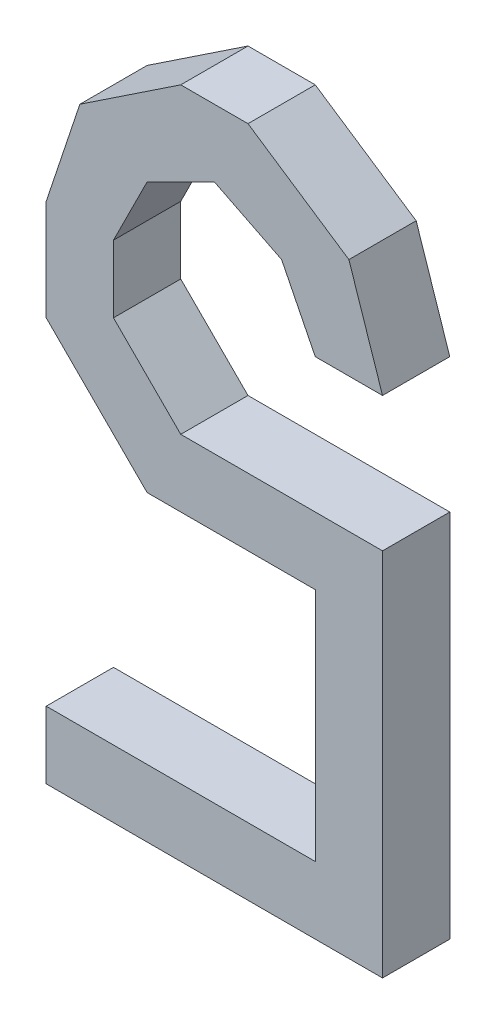
ISO-10303-21;
HEADER;
FILE_DESCRIPTION(('STEP AP214'),'2;1');
FILE_NAME('part.step','',(''),(''),'','','');
FILE_SCHEMA(('AUTOMOTIVE_DESIGN { 1 0 10303 214 1 1 1 1 }'));
ENDSEC;
DATA;
#1=APPLICATION_CONTEXT('core data for automotive mechanical design processes');
#2=APPLICATION_PROTOCOL_DEFINITION('international standard','automotive_design',2000,#1);
#3=PRODUCT_CONTEXT('',#1,'mechanical');
#4=PRODUCT('Part','Part','',(#3));
#5=PRODUCT_RELATED_PRODUCT_CATEGORY('part','',(#4));
#6=PRODUCT_DEFINITION_FORMATION('','',#4);
#7=PRODUCT_DEFINITION_CONTEXT('part definition',#1,'design');
#8=PRODUCT_DEFINITION('design','',#6,#7);
#9=PRODUCT_DEFINITION_SHAPE('','',#8);
#10=(LENGTH_UNIT() NAMED_UNIT(*) SI_UNIT(.MILLI.,.METRE.));
#11=(NAMED_UNIT(*) PLANE_ANGLE_UNIT() SI_UNIT($,.RADIAN.));
#12=(NAMED_UNIT(*) SI_UNIT($,.STERADIAN.) SOLID_ANGLE_UNIT());
#13=UNCERTAINTY_MEASURE_WITH_UNIT(LENGTH_MEASURE(1.E-05),#10,'distance_accuracy_value','');
#14=(GEOMETRIC_REPRESENTATION_CONTEXT(3) GLOBAL_UNCERTAINTY_ASSIGNED_CONTEXT((#13)) GLOBAL_UNIT_ASSIGNED_CONTEXT((#10,
#11,#12)) REPRESENTATION_CONTEXT('',''));
#15=CARTESIAN_POINT('',(0.,0.,0.));
#16=DIRECTION('',(0.,0.,1.));
#17=DIRECTION('',(1.,0.,0.));
#18=AXIS2_PLACEMENT_3D('',#15,#16,#17);
#19=CARTESIAN_POINT('',(-0.0635,-0.127,0.0254));
#20=DIRECTION('',(0.,0.,1.));
#21=DIRECTION('',(1.,0.,0.));
#22=AXIS2_PLACEMENT_3D('',#19,#20,#21);
#23=PLANE('',#22);
#24=DIRECTION('',(1.,0.,0.));
#25=VECTOR('',#24,1.);
#26=CARTESIAN_POINT('',(-0.0635,-0.1016,0.0254));
#27=LINE('',#26,#25);
#28=CARTESIAN_POINT('',(-0.0635,-0.1016,0.0254));
#29=VERTEX_POINT('',#28);
#30=CARTESIAN_POINT('',(0.0381,-0.1016,0.0254));
#31=VERTEX_POINT('',#30);
#32=EDGE_CURVE('E247',#29,#31,#27,.T.);
#33=ORIENTED_EDGE('',*,*,#32,.F.);
#34=DIRECTION('',(0.,1.,0.));
#35=VECTOR('',#34,1.);
#36=CARTESIAN_POINT('',(-0.0635,-0.127,0.0254));
#37=LINE('',#36,#35);
#38=CARTESIAN_POINT('',(-0.0635,-0.127,0.0254));
#39=VERTEX_POINT('',#38);
#40=EDGE_CURVE('E172',#39,#29,#37,.T.);
#41=ORIENTED_EDGE('',*,*,#40,.F.);
#42=DIRECTION('',(1.,0.,0.));
#43=VECTOR('',#42,1.);
#44=CARTESIAN_POINT('',(0.0635,-0.127,0.0254));
#45=LINE('',#44,#43);
#46=CARTESIAN_POINT('',(0.0635,-0.127,0.0254));
#47=VERTEX_POINT('',#46);
#48=EDGE_CURVE('E20',#47,#39,#45,.F.);
#49=ORIENTED_EDGE('',*,*,#48,.F.);
#50=DIRECTION('',(0.,1.,0.));
#51=VECTOR('',#50,1.);
#52=CARTESIAN_POINT('',(0.0635,0.0127,0.0254));
#53=LINE('',#52,#51);
#54=CARTESIAN_POINT('',(0.0635,0.0127,0.0254));
#55=VERTEX_POINT('',#54);
#56=EDGE_CURVE('E161',#55,#47,#53,.F.);
#57=ORIENTED_EDGE('',*,*,#56,.F.);
#58=DIRECTION('',(1.,0.,0.));
#59=VECTOR('',#58,1.);
#60=CARTESIAN_POINT('',(-0.0127,0.0127,0.0254));
#61=LINE('',#60,#59);
#62=CARTESIAN_POINT('',(-0.0126999999999968,0.0127000000000032,0.0254));
#63=VERTEX_POINT('',#62);
#64=EDGE_CURVE('E156',#63,#55,#61,.T.);
#65=ORIENTED_EDGE('',*,*,#64,.F.);
#66=DIRECTION('',(-0.707106781187048,0.707106781186048,0.));
#67=VECTOR('',#66,1.);
#68=CARTESIAN_POINT('',(-0.0381,0.03809999999999,0.0254));
#69=LINE('',#68,#67);
#70=CARTESIAN_POINT('',(-0.0381,0.03809999999999,0.0254));
#71=VERTEX_POINT('',#70);
#72=EDGE_CURVE('E183',#71,#63,#69,.F.);
#73=ORIENTED_EDGE('',*,*,#72,.F.);
#74=DIRECTION('',(0.,1.,0.));
#75=VECTOR('',#74,1.);
#76=CARTESIAN_POINT('',(-0.0381,0.06349999999998,0.0254));
#77=LINE('',#76,#75);
#78=CARTESIAN_POINT('',(-0.038100000000002,0.063499999999981,0.0254));
#79=VERTEX_POINT('',#78);
#80=EDGE_CURVE('E187',#79,#71,#77,.F.);
#81=ORIENTED_EDGE('',*,*,#80,.F.);
#82=DIRECTION('',(0.447213595499958,0.894427190999916,0.));
#83=VECTOR('',#82,1.);
#84=CARTESIAN_POINT('',(-0.0254,0.0889,0.0254));
#85=LINE('',#84,#83);
#86=CARTESIAN_POINT('',(-0.0254,0.0889,0.0254));
#87=VERTEX_POINT('',#86);
#88=EDGE_CURVE('E191',#87,#79,#85,.F.);
#89=ORIENTED_EDGE('',*,*,#88,.F.);
#90=DIRECTION('',(0.894427190999916,0.447213595499958,0.));
#91=VECTOR('',#90,1.);
#92=CARTESIAN_POINT('',(0.,0.1016,0.0254));
#93=LINE('',#92,#91);
#94=CARTESIAN_POINT('',(0.,0.1016,0.0254));
#95=VERTEX_POINT('',#94);
#96=EDGE_CURVE('E195',#95,#87,#93,.F.);
#97=ORIENTED_EDGE('',*,*,#96,.F.);
#98=DIRECTION('',(0.894427190999916,-0.447213595499958,0.));
#99=VECTOR('',#98,1.);
#100=CARTESIAN_POINT('',(0.0254,0.0889,0.0254));
#101=LINE('',#100,#99);
#102=CARTESIAN_POINT('',(0.025399999999998,0.088899999999999,0.0254));
#103=VERTEX_POINT('',#102);
#104=EDGE_CURVE('E199',#103,#95,#101,.F.);
#105=ORIENTED_EDGE('',*,*,#104,.F.);
#106=DIRECTION('',(0.447213595499958,-0.894427190999916,0.));
#107=VECTOR('',#106,1.);
#108=CARTESIAN_POINT('',(0.0381,0.06349999999998,0.0254));
#109=LINE('',#108,#107);
#110=CARTESIAN_POINT('',(0.0381,0.06349999999998,0.0254));
#111=VERTEX_POINT('',#110);
#112=EDGE_CURVE('E203',#111,#103,#109,.F.);
#113=ORIENTED_EDGE('',*,*,#112,.F.);
#114=DIRECTION('',(1.,0.,0.));
#115=VECTOR('',#114,1.);
#116=CARTESIAN_POINT('',(0.0635,0.06349999999998,0.0254));
#117=LINE('',#116,#115);
#118=CARTESIAN_POINT('',(0.0635000000000045,0.0634999999999815,0.0254));
#119=VERTEX_POINT('',#118);
#120=EDGE_CURVE('E207',#119,#111,#117,.F.);
#121=ORIENTED_EDGE('',*,*,#120,.F.);
#122=DIRECTION('',(-0.316227766017138,0.948683298050414,0.));
#123=VECTOR('',#122,1.);
#124=CARTESIAN_POINT('',(0.0508,0.1016,0.0254));
#125=LINE('',#124,#123);
#126=CARTESIAN_POINT('',(0.0508000000000018,0.101600000000003,0.0254));
#127=VERTEX_POINT('',#126);
#128=EDGE_CURVE('E211',#127,#119,#125,.F.);
#129=ORIENTED_EDGE('',*,*,#128,.F.);
#130=DIRECTION('',(-0.832050294337997,0.554700196224998,0.));
#131=VECTOR('',#130,1.);
#132=CARTESIAN_POINT('',(0.0127,0.127,0.0254));
#133=LINE('',#132,#131);
#134=CARTESIAN_POINT('',(0.0127,0.127,0.0254));
#135=VERTEX_POINT('',#134);
#136=EDGE_CURVE('E215',#135,#127,#133,.F.);
#137=ORIENTED_EDGE('',*,*,#136,.F.);
#138=DIRECTION('',(1.,0.,0.));
#139=VECTOR('',#138,1.);
#140=CARTESIAN_POINT('',(-0.0127,0.127,0.0254));
#141=LINE('',#140,#139);
#142=CARTESIAN_POINT('',(-0.0126999999999982,0.126999999999997,0.0254));
#143=VERTEX_POINT('',#142);
#144=EDGE_CURVE('E219',#143,#135,#141,.T.);
#145=ORIENTED_EDGE('',*,*,#144,.F.);
#146=DIRECTION('',(-0.832050294337997,-0.554700196224998,0.));
#147=VECTOR('',#146,1.);
#148=CARTESIAN_POINT('',(-0.0508,0.1016,0.0254));
#149=LINE('',#148,#147);
#150=CARTESIAN_POINT('',(-0.0507999999999955,0.101599999999999,0.0254));
#151=VERTEX_POINT('',#150);
#152=EDGE_CURVE('E223',#151,#143,#149,.F.);
#153=ORIENTED_EDGE('',*,*,#152,.F.);
#154=DIRECTION('',(-0.316227766017138,-0.948683298050414,0.));
#155=VECTOR('',#154,1.);
#156=CARTESIAN_POINT('',(-0.0635,0.06349999999998,0.0254));
#157=LINE('',#156,#155);
#158=CARTESIAN_POINT('',(-0.0635,0.06349999999998,0.0254));
#159=VERTEX_POINT('',#158);
#160=EDGE_CURVE('E227',#159,#151,#157,.F.);
#161=ORIENTED_EDGE('',*,*,#160,.F.);
#162=DIRECTION('',(0.,1.,0.));
#163=VECTOR('',#162,1.);
#164=CARTESIAN_POINT('',(-0.0635,0.02539999999999,0.0254));
#165=LINE('',#164,#163);
#166=CARTESIAN_POINT('',(-0.0634999999999945,0.0253999999999955,0.0254));
#167=VERTEX_POINT('',#166);
#168=EDGE_CURVE('E231',#167,#159,#165,.T.);
#169=ORIENTED_EDGE('',*,*,#168,.F.);
#170=DIRECTION('',(0.707106781186048,-0.707106781187048,0.));
#171=VECTOR('',#170,1.);
#172=CARTESIAN_POINT('',(-0.0254,-0.01270000000002,0.0254));
#173=LINE('',#172,#171);
#174=CARTESIAN_POINT('',(-0.0254,-0.01270000000002,0.0254));
#175=VERTEX_POINT('',#174);
#176=EDGE_CURVE('E235',#175,#167,#173,.F.);
#177=ORIENTED_EDGE('',*,*,#176,.F.);
#178=DIRECTION('',(1.,0.,0.));
#179=VECTOR('',#178,1.);
#180=CARTESIAN_POINT('',(0.0381,-0.01270000000002,0.0254));
#181=LINE('',#180,#179);
#182=CARTESIAN_POINT('',(0.0381,-0.01270000000002,0.0254));
#183=VERTEX_POINT('',#182);
#184=EDGE_CURVE('E239',#183,#175,#181,.F.);
#185=ORIENTED_EDGE('',*,*,#184,.F.);
#186=DIRECTION('',(0.,1.,0.));
#187=VECTOR('',#186,1.);
#188=CARTESIAN_POINT('',(0.0381,-0.1016,0.0254));
#189=LINE('',#188,#187);
#190=EDGE_CURVE('E243',#31,#183,#189,.T.);
#191=ORIENTED_EDGE('',*,*,#190,.F.);
#192=EDGE_LOOP('',(#33,#41,#49,#57,#65,#73,#81,#89,#97,#105,#113,#121,#129,#137,#145,#153,#161,
#169,#177,#185,#191));
#193=FACE_BOUND('',#192,.T.);
#194=ADVANCED_FACE('F17',(#193),#23,.T.);
#195=CARTESIAN_POINT('',(0.0635,-0.127,0.));
#196=DIRECTION('',(0.,-1.,0.));
#197=DIRECTION('',(0.,0.,-1.));
#198=AXIS2_PLACEMENT_3D('',#195,#196,#197);
#199=PLANE('',#198);
#200=DIRECTION('',(0.,0.,1.));
#201=VECTOR('',#200,1.);
#202=CARTESIAN_POINT('',(-0.0635,-0.127,0.));
#203=LINE('',#202,#201);
#204=CARTESIAN_POINT('',(-0.0635,-0.127,0.));
#205=VERTEX_POINT('',#204);
#206=EDGE_CURVE('E251',#205,#39,#203,.T.);
#207=ORIENTED_EDGE('',*,*,#206,.F.);
#208=DIRECTION('',(1.,0.,0.));
#209=VECTOR('',#208,1.);
#210=CARTESIAN_POINT('',(-0.0635,-0.127,0.));
#211=LINE('',#210,#209);
#212=CARTESIAN_POINT('',(0.0635,-0.127,0.));
#213=VERTEX_POINT('',#212);
#214=EDGE_CURVE('E178',#205,#213,#211,.T.);
#215=ORIENTED_EDGE('',*,*,#214,.T.);
#216=DIRECTION('',(0.,0.,-1.));
#217=VECTOR('',#216,1.);
#218=CARTESIAN_POINT('',(0.0635,-0.127,0.));
#219=LINE('',#218,#217);
#220=EDGE_CURVE('E166',#47,#213,#219,.T.);
#221=ORIENTED_EDGE('',*,*,#220,.F.);
#222=ORIENTED_EDGE('',*,*,#48,.T.);
#223=EDGE_LOOP('',(#207,#215,#221,#222));
#224=FACE_BOUND('',#223,.T.);
#225=ADVANCED_FACE('F177',(#224),#199,.T.);
#226=CARTESIAN_POINT('',(0.0635,0.0127,0.));
#227=DIRECTION('',(1.,0.,0.));
#228=DIRECTION('',(0.,0.,-1.));
#229=AXIS2_PLACEMENT_3D('',#226,#227,#228);
#230=PLANE('',#229);
#231=ORIENTED_EDGE('',*,*,#220,.T.);
#232=DIRECTION('',(0.,1.,0.));
#233=VECTOR('',#232,1.);
#234=CARTESIAN_POINT('',(0.0635,-0.127,0.));
#235=LINE('',#234,#233);
#236=CARTESIAN_POINT('',(0.0635,0.0127,0.));
#237=VERTEX_POINT('',#236);
#238=EDGE_CURVE('E256',#213,#237,#235,.T.);
#239=ORIENTED_EDGE('',*,*,#238,.T.);
#240=DIRECTION('',(0.,0.,1.));
#241=VECTOR('',#240,1.);
#242=CARTESIAN_POINT('',(0.0635,0.0127,0.));
#243=LINE('',#242,#241);
#244=EDGE_CURVE('E168',#55,#237,#243,.F.);
#245=ORIENTED_EDGE('',*,*,#244,.F.);
#246=ORIENTED_EDGE('',*,*,#56,.T.);
#247=EDGE_LOOP('',(#231,#239,#245,#246));
#248=FACE_BOUND('',#247,.T.);
#249=ADVANCED_FACE('F163',(#248),#230,.T.);
#250=CARTESIAN_POINT('',(-0.0127,0.0127,0.));
#251=DIRECTION('',(0.,1.,0.));
#252=DIRECTION('',(0.,0.,1.));
#253=AXIS2_PLACEMENT_3D('',#250,#251,#252);
#254=PLANE('',#253);
#255=ORIENTED_EDGE('',*,*,#244,.T.);
#256=DIRECTION('',(1.,0.,0.));
#257=VECTOR('',#256,1.);
#258=CARTESIAN_POINT('',(-0.0635,0.0127,0.));
#259=LINE('',#258,#257);
#260=CARTESIAN_POINT('',(-0.0126999999999968,0.0127000000000032,0.));
#261=VERTEX_POINT('',#260);
#262=EDGE_CURVE('E258',#237,#261,#259,.F.);
#263=ORIENTED_EDGE('',*,*,#262,.T.);
#264=DIRECTION('',(0.,0.,1.));
#265=VECTOR('',#264,1.);
#266=CARTESIAN_POINT('',(-0.012699999999987,0.012700000000013,0.));
#267=LINE('',#266,#265);
#268=EDGE_CURVE('E185',#63,#261,#267,.F.);
#269=ORIENTED_EDGE('',*,*,#268,.F.);
#270=ORIENTED_EDGE('',*,*,#64,.T.);
#271=EDGE_LOOP('',(#255,#263,#269,#270));
#272=FACE_BOUND('',#271,.T.);
#273=ADVANCED_FACE('F396',(#272),#254,.T.);
#274=CARTESIAN_POINT('',(-0.0381,0.03809999999999,0.));
#275=DIRECTION('',(0.707106781186048,0.707106781187048,0.));
#276=DIRECTION('',(-0.707106781187048,0.707106781186048,0.));
#277=AXIS2_PLACEMENT_3D('',#274,#275,#276);
#278=PLANE('',#277);
#279=ORIENTED_EDGE('',*,*,#268,.T.);
#280=DIRECTION('',(-0.707106781186687,0.707106781186408,0.));
#281=VECTOR('',#280,1.);
#282=CARTESIAN_POINT('',(-0.0127,0.0127,0.));
#283=LINE('',#282,#281);
#284=CARTESIAN_POINT('',(-0.0381,0.03809999999999,0.));
#285=VERTEX_POINT('',#284);
#286=EDGE_CURVE('E261',#261,#285,#283,.T.);
#287=ORIENTED_EDGE('',*,*,#286,.T.);
#288=DIRECTION('',(0.,0.,-1.));
#289=VECTOR('',#288,1.);
#290=CARTESIAN_POINT('',(-0.0381,0.03809999999999,0.));
#291=LINE('',#290,#289);
#292=EDGE_CURVE('E189',#71,#285,#291,.T.);
#293=ORIENTED_EDGE('',*,*,#292,.F.);
#294=ORIENTED_EDGE('',*,*,#72,.T.);
#295=EDGE_LOOP('',(#279,#287,#293,#294));
#296=FACE_BOUND('',#295,.T.);
#297=ADVANCED_FACE('F394',(#296),#278,.T.);
#298=CARTESIAN_POINT('',(-0.0381,0.06349999999998,0.));
#299=DIRECTION('',(1.,0.,0.));
#300=DIRECTION('',(0.,0.,-1.));
#301=AXIS2_PLACEMENT_3D('',#298,#299,#300);
#302=PLANE('',#301);
#303=ORIENTED_EDGE('',*,*,#292,.T.);
#304=DIRECTION('',(0.,1.,0.));
#305=VECTOR('',#304,1.);
#306=CARTESIAN_POINT('',(-0.0381,-0.127,0.));
#307=LINE('',#306,#305);
#308=CARTESIAN_POINT('',(-0.038100000000002,0.063499999999981,0.));
#309=VERTEX_POINT('',#308);
#310=EDGE_CURVE('E264',#285,#309,#307,.T.);
#311=ORIENTED_EDGE('',*,*,#310,.T.);
#312=DIRECTION('',(0.,0.,1.));
#313=VECTOR('',#312,1.);
#314=CARTESIAN_POINT('',(-0.038100000000008,0.063499999999984,0.));
#315=LINE('',#314,#313);
#316=EDGE_CURVE('E193',#79,#309,#315,.F.);
#317=ORIENTED_EDGE('',*,*,#316,.F.);
#318=ORIENTED_EDGE('',*,*,#80,.T.);
#319=EDGE_LOOP('',(#303,#311,#317,#318));
#320=FACE_BOUND('',#319,.T.);
#321=ADVANCED_FACE('F390',(#320),#302,.T.);
#322=CARTESIAN_POINT('',(-0.0254,0.0889,0.));
#323=DIRECTION('',(0.894427190999916,-0.447213595499958,0.));
#324=DIRECTION('',(0.447213595499958,0.894427190999916,0.));
#325=AXIS2_PLACEMENT_3D('',#322,#323,#324);
#326=PLANE('',#325);
#327=ORIENTED_EDGE('',*,*,#316,.T.);
#328=DIRECTION('',(0.447213595499677,0.894427191000056,0.));
#329=VECTOR('',#328,1.);
#330=CARTESIAN_POINT('',(-0.0381,0.06349999999998,0.));
#331=LINE('',#330,#329);
#332=CARTESIAN_POINT('',(-0.0254,0.0889,0.));
#333=VERTEX_POINT('',#332);
#334=EDGE_CURVE('E267',#309,#333,#331,.T.);
#335=ORIENTED_EDGE('',*,*,#334,.T.);
#336=DIRECTION('',(0.,0.,1.));
#337=VECTOR('',#336,1.);
#338=CARTESIAN_POINT('',(-0.0254,0.0889,0.));
#339=LINE('',#338,#337);
#340=EDGE_CURVE('E197',#87,#333,#339,.F.);
#341=ORIENTED_EDGE('',*,*,#340,.F.);
#342=ORIENTED_EDGE('',*,*,#88,.T.);
#343=EDGE_LOOP('',(#327,#335,#341,#342));
#344=FACE_BOUND('',#343,.T.);
#345=ADVANCED_FACE('F384',(#344),#326,.T.);
#346=CARTESIAN_POINT('',(0.,0.1016,0.));
#347=DIRECTION('',(0.447213595499958,-0.894427190999916,0.));
#348=DIRECTION('',(0.894427190999916,0.447213595499958,0.));
#349=AXIS2_PLACEMENT_3D('',#346,#347,#348);
#350=PLANE('',#349);
#351=ORIENTED_EDGE('',*,*,#340,.T.);
#352=DIRECTION('',(0.894427190999916,0.447213595499958,0.));
#353=VECTOR('',#352,1.);
#354=CARTESIAN_POINT('',(-0.0254,0.0889,0.));
#355=LINE('',#354,#353);
#356=CARTESIAN_POINT('',(0.,0.1016,0.));
#357=VERTEX_POINT('',#356);
#358=EDGE_CURVE('E270',#333,#357,#355,.T.);
#359=ORIENTED_EDGE('',*,*,#358,.T.);
#360=DIRECTION('',(0.,0.,1.));
#361=VECTOR('',#360,1.);
#362=CARTESIAN_POINT('',(0.,0.1016,0.));
#363=LINE('',#362,#361);
#364=EDGE_CURVE('E201',#95,#357,#363,.F.);
#365=ORIENTED_EDGE('',*,*,#364,.F.);
#366=ORIENTED_EDGE('',*,*,#96,.T.);
#367=EDGE_LOOP('',(#351,#359,#365,#366));
#368=FACE_BOUND('',#367,.T.);
#369=ADVANCED_FACE('F380',(#368),#350,.T.);
#370=CARTESIAN_POINT('',(0.0254,0.0889,0.));
#371=DIRECTION('',(-0.447213595499958,-0.894427190999916,0.));
#372=DIRECTION('',(0.894427190999916,-0.447213595499958,0.));
#373=AXIS2_PLACEMENT_3D('',#370,#371,#372);
#374=PLANE('',#373);
#375=ORIENTED_EDGE('',*,*,#364,.T.);
#376=DIRECTION('',(0.894427190999916,-0.447213595499958,0.));
#377=VECTOR('',#376,1.);
#378=CARTESIAN_POINT('',(0.,0.1016,0.));
#379=LINE('',#378,#377);
#380=CARTESIAN_POINT('',(0.025399999999998,0.088899999999999,0.));
#381=VERTEX_POINT('',#380);
#382=EDGE_CURVE('E273',#357,#381,#379,.T.);
#383=ORIENTED_EDGE('',*,*,#382,.T.);
#384=DIRECTION('',(0.,0.,1.));
#385=VECTOR('',#384,1.);
#386=CARTESIAN_POINT('',(0.025399999999992,0.088899999999996,0.));
#387=LINE('',#386,#385);
#388=EDGE_CURVE('E205',#103,#381,#387,.F.);
#389=ORIENTED_EDGE('',*,*,#388,.F.);
#390=ORIENTED_EDGE('',*,*,#104,.T.);
#391=EDGE_LOOP('',(#375,#383,#389,#390));
#392=FACE_BOUND('',#391,.T.);
#393=ADVANCED_FACE('F374',(#392),#374,.T.);
#394=CARTESIAN_POINT('',(0.0381,0.06349999999998,0.));
#395=DIRECTION('',(-0.894427190999916,-0.447213595499958,0.));
#396=DIRECTION('',(0.447213595499958,-0.894427190999916,0.));
#397=AXIS2_PLACEMENT_3D('',#394,#395,#396);
#398=PLANE('',#397);
#399=ORIENTED_EDGE('',*,*,#388,.T.);
#400=DIRECTION('',(0.447213595499677,-0.894427191000056,0.));
#401=VECTOR('',#400,1.);
#402=CARTESIAN_POINT('',(0.0254,0.0889,0.));
#403=LINE('',#402,#401);
#404=CARTESIAN_POINT('',(0.0381,0.06349999999998,0.));
#405=VERTEX_POINT('',#404);
#406=EDGE_CURVE('E276',#381,#405,#403,.T.);
#407=ORIENTED_EDGE('',*,*,#406,.T.);
#408=DIRECTION('',(0.,0.,-1.));
#409=VECTOR('',#408,1.);
#410=CARTESIAN_POINT('',(0.0381,0.06349999999998,0.));
#411=LINE('',#410,#409);
#412=EDGE_CURVE('E209',#111,#405,#411,.T.);
#413=ORIENTED_EDGE('',*,*,#412,.F.);
#414=ORIENTED_EDGE('',*,*,#112,.T.);
#415=EDGE_LOOP('',(#399,#407,#413,#414));
#416=FACE_BOUND('',#415,.T.);
#417=ADVANCED_FACE('F370',(#416),#398,.T.);
#418=CARTESIAN_POINT('',(0.0635,0.06349999999998,0.));
#419=DIRECTION('',(0.,-1.,0.));
#420=DIRECTION('',(0.,0.,-1.));
#421=AXIS2_PLACEMENT_3D('',#418,#419,#420);
#422=PLANE('',#421);
#423=ORIENTED_EDGE('',*,*,#412,.T.);
#424=DIRECTION('',(1.,0.,0.));
#425=VECTOR('',#424,1.);
#426=CARTESIAN_POINT('',(-0.0635,0.06349999999998,0.));
#427=LINE('',#426,#425);
#428=CARTESIAN_POINT('',(0.0635000000000045,0.0634999999999815,0.));
#429=VERTEX_POINT('',#428);
#430=EDGE_CURVE('E279',#405,#429,#427,.T.);
#431=ORIENTED_EDGE('',*,*,#430,.T.);
#432=DIRECTION('',(0.,0.,1.));
#433=VECTOR('',#432,1.);
#434=CARTESIAN_POINT('',(0.0635000000000181,0.063499999999986,0.));
#435=LINE('',#434,#433);
#436=EDGE_CURVE('E213',#119,#429,#435,.F.);
#437=ORIENTED_EDGE('',*,*,#436,.F.);
#438=ORIENTED_EDGE('',*,*,#120,.T.);
#439=EDGE_LOOP('',(#423,#431,#437,#438));
#440=FACE_BOUND('',#439,.T.);
#441=ADVANCED_FACE('F364',(#440),#422,.T.);
#442=CARTESIAN_POINT('',(0.0508,0.1016,0.));
#443=DIRECTION('',(0.948683298050414,0.316227766017138,0.));
#444=DIRECTION('',(-0.316227766017138,0.948683298050414,0.));
#445=AXIS2_PLACEMENT_3D('',#442,#443,#444);
#446=PLANE('',#445);
#447=ORIENTED_EDGE('',*,*,#436,.T.);
#448=DIRECTION('',(-0.316227766016689,0.948683298050564,0.));
#449=VECTOR('',#448,1.);
#450=CARTESIAN_POINT('',(0.0635,0.06349999999998,0.));
#451=LINE('',#450,#449);
#452=CARTESIAN_POINT('',(0.0508000000000018,0.101600000000003,0.));
#453=VERTEX_POINT('',#452);
#454=EDGE_CURVE('E282',#429,#453,#451,.T.);
#455=ORIENTED_EDGE('',*,*,#454,.T.);
#456=DIRECTION('',(0.,0.,1.));
#457=VECTOR('',#456,1.);
#458=CARTESIAN_POINT('',(0.050800000000007,0.101600000000011,0.));
#459=LINE('',#458,#457);
#460=EDGE_CURVE('E217',#127,#453,#459,.F.);
#461=ORIENTED_EDGE('',*,*,#460,.F.);
#462=ORIENTED_EDGE('',*,*,#128,.T.);
#463=EDGE_LOOP('',(#447,#455,#461,#462));
#464=FACE_BOUND('',#463,.T.);
#465=ADVANCED_FACE('F360',(#464),#446,.T.);
#466=CARTESIAN_POINT('',(0.0127,0.127,0.));
#467=DIRECTION('',(0.554700196224998,0.832050294337997,0.));
#468=DIRECTION('',(-0.832050294337997,0.554700196224998,0.));
#469=AXIS2_PLACEMENT_3D('',#466,#467,#468);
#470=PLANE('',#469);
#471=ORIENTED_EDGE('',*,*,#460,.T.);
#472=DIRECTION('',(-0.832050294337844,0.554700196225229,0.));
#473=VECTOR('',#472,1.);
#474=CARTESIAN_POINT('',(0.0508,0.1016,0.));
#475=LINE('',#474,#473);
#476=CARTESIAN_POINT('',(0.0127,0.127,0.));
#477=VERTEX_POINT('',#476);
#478=EDGE_CURVE('E285',#453,#477,#475,.T.);
#479=ORIENTED_EDGE('',*,*,#478,.T.);
#480=DIRECTION('',(0.,0.,1.));
#481=VECTOR('',#480,1.);
#482=CARTESIAN_POINT('',(0.0127,0.127,0.));
#483=LINE('',#482,#481);
#484=EDGE_CURVE('E221',#135,#477,#483,.F.);
#485=ORIENTED_EDGE('',*,*,#484,.F.);
#486=ORIENTED_EDGE('',*,*,#136,.T.);
#487=EDGE_LOOP('',(#471,#479,#485,#486));
#488=FACE_BOUND('',#487,.T.);
#489=ADVANCED_FACE('F354',(#488),#470,.T.);
#490=CARTESIAN_POINT('',(-0.0127,0.127,0.));
#491=DIRECTION('',(0.,1.,0.));
#492=DIRECTION('',(0.,0.,1.));
#493=AXIS2_PLACEMENT_3D('',#490,#491,#492);
#494=PLANE('',#493);
#495=ORIENTED_EDGE('',*,*,#484,.T.);
#496=DIRECTION('',(1.,0.,0.));
#497=VECTOR('',#496,1.);
#498=CARTESIAN_POINT('',(-0.0635,0.127,0.));
#499=LINE('',#498,#497);
#500=CARTESIAN_POINT('',(-0.0126999999999982,0.126999999999997,0.));
#501=VERTEX_POINT('',#500);
#502=EDGE_CURVE('E288',#477,#501,#499,.F.);
#503=ORIENTED_EDGE('',*,*,#502,.T.);
#504=DIRECTION('',(0.,0.,1.));
#505=VECTOR('',#504,1.);
#506=CARTESIAN_POINT('',(-0.012699999999993,0.126999999999989,0.));
#507=LINE('',#506,#505);
#508=EDGE_CURVE('E225',#143,#501,#507,.F.);
#509=ORIENTED_EDGE('',*,*,#508,.F.);
#510=ORIENTED_EDGE('',*,*,#144,.T.);
#511=EDGE_LOOP('',(#495,#503,#509,#510));
#512=FACE_BOUND('',#511,.T.);
#513=ADVANCED_FACE('F350',(#512),#494,.T.);
#514=CARTESIAN_POINT('',(-0.0508,0.1016,0.));
#515=DIRECTION('',(-0.554700196224998,0.832050294337997,0.));
#516=DIRECTION('',(-0.832050294337997,-0.554700196224998,0.));
#517=AXIS2_PLACEMENT_3D('',#514,#515,#516);
#518=PLANE('',#517);
#519=ORIENTED_EDGE('',*,*,#508,.T.);
#520=DIRECTION('',(-0.832050294337844,-0.554700196225229,0.));
#521=VECTOR('',#520,1.);
#522=CARTESIAN_POINT('',(-0.0127,0.127,0.));
#523=LINE('',#522,#521);
#524=CARTESIAN_POINT('',(-0.0507999999999955,0.101599999999998,0.));
#525=VERTEX_POINT('',#524);
#526=EDGE_CURVE('E291',#501,#525,#523,.T.);
#527=ORIENTED_EDGE('',*,*,#526,.T.);
#528=DIRECTION('',(0.,0.,1.));
#529=VECTOR('',#528,1.);
#530=CARTESIAN_POINT('',(-0.0507999999999819,0.101599999999994,0.));
#531=LINE('',#530,#529);
#532=EDGE_CURVE('E229',#151,#525,#531,.F.);
#533=ORIENTED_EDGE('',*,*,#532,.F.);
#534=ORIENTED_EDGE('',*,*,#152,.T.);
#535=EDGE_LOOP('',(#519,#527,#533,#534));
#536=FACE_BOUND('',#535,.T.);
#537=ADVANCED_FACE('F344',(#536),#518,.T.);
#538=CARTESIAN_POINT('',(-0.0635,0.06349999999998,0.));
#539=DIRECTION('',(-0.948683298050414,0.316227766017138,0.));
#540=DIRECTION('',(-0.316227766017138,-0.948683298050414,0.));
#541=AXIS2_PLACEMENT_3D('',#538,#539,#540);
#542=PLANE('',#541);
#543=ORIENTED_EDGE('',*,*,#532,.T.);
#544=DIRECTION('',(-0.316227766016689,-0.948683298050564,0.));
#545=VECTOR('',#544,1.);
#546=CARTESIAN_POINT('',(-0.0508,0.1016,0.));
#547=LINE('',#546,#545);
#548=CARTESIAN_POINT('',(-0.0635,0.06349999999998,0.));
#549=VERTEX_POINT('',#548);
#550=EDGE_CURVE('E294',#525,#549,#547,.T.);
#551=ORIENTED_EDGE('',*,*,#550,.T.);
#552=DIRECTION('',(0.,0.,1.));
#553=VECTOR('',#552,1.);
#554=CARTESIAN_POINT('',(-0.0635,0.06349999999998,0.));
#555=LINE('',#554,#553);
#556=EDGE_CURVE('E233',#159,#549,#555,.F.);
#557=ORIENTED_EDGE('',*,*,#556,.F.);
#558=ORIENTED_EDGE('',*,*,#160,.T.);
#559=EDGE_LOOP('',(#543,#551,#557,#558));
#560=FACE_BOUND('',#559,.T.);
#561=ADVANCED_FACE('F340',(#560),#542,.T.);
#562=CARTESIAN_POINT('',(-0.0635,0.02539999999999,0.));
#563=DIRECTION('',(-1.,0.,0.));
#564=DIRECTION('',(0.,0.,1.));
#565=AXIS2_PLACEMENT_3D('',#562,#563,#564);
#566=PLANE('',#565);
#567=ORIENTED_EDGE('',*,*,#556,.T.);
#568=DIRECTION('',(0.,1.,0.));
#569=VECTOR('',#568,1.);
#570=CARTESIAN_POINT('',(-0.0635,-0.127,0.));
#571=LINE('',#570,#569);
#572=CARTESIAN_POINT('',(-0.0634999999999945,0.0253999999999955,0.));
#573=VERTEX_POINT('',#572);
#574=EDGE_CURVE('E297',#549,#573,#571,.F.);
#575=ORIENTED_EDGE('',*,*,#574,.T.);
#576=DIRECTION('',(0.,0.,1.));
#577=VECTOR('',#576,1.);
#578=CARTESIAN_POINT('',(-0.0634999999999781,0.0254000000000119,0.));
#579=LINE('',#578,#577);
#580=EDGE_CURVE('E237',#167,#573,#579,.F.);
#581=ORIENTED_EDGE('',*,*,#580,.F.);
#582=ORIENTED_EDGE('',*,*,#168,.T.);
#583=EDGE_LOOP('',(#567,#575,#581,#582));
#584=FACE_BOUND('',#583,.T.);
#585=ADVANCED_FACE('F334',(#584),#566,.T.);
#586=CARTESIAN_POINT('',(-0.0254,-0.01270000000002,0.));
#587=DIRECTION('',(-0.707106781187048,-0.707106781186048,0.));
#588=DIRECTION('',(0.707106781186048,-0.707106781187048,0.));
#589=AXIS2_PLACEMENT_3D('',#586,#587,#588);
#590=PLANE('',#589);
#591=ORIENTED_EDGE('',*,*,#580,.T.);
#592=DIRECTION('',(0.707106781186455,-0.70710678118664,0.));
#593=VECTOR('',#592,1.);
#594=CARTESIAN_POINT('',(-0.0635,0.02539999999999,0.));
#595=LINE('',#594,#593);
#596=CARTESIAN_POINT('',(-0.0254,-0.01270000000002,0.));
#597=VERTEX_POINT('',#596);
#598=EDGE_CURVE('E300',#573,#597,#595,.T.);
#599=ORIENTED_EDGE('',*,*,#598,.T.);
#600=DIRECTION('',(0.,0.,-1.));
#601=VECTOR('',#600,1.);
#602=CARTESIAN_POINT('',(-0.0254,-0.01270000000002,0.));
#603=LINE('',#602,#601);
#604=EDGE_CURVE('E241',#175,#597,#603,.T.);
#605=ORIENTED_EDGE('',*,*,#604,.F.);
#606=ORIENTED_EDGE('',*,*,#176,.T.);
#607=EDGE_LOOP('',(#591,#599,#605,#606));
#608=FACE_BOUND('',#607,.T.);
#609=ADVANCED_FACE('F330',(#608),#590,.T.);
#610=CARTESIAN_POINT('',(0.0381,-0.01270000000002,0.));
#611=DIRECTION('',(0.,-1.,0.));
#612=DIRECTION('',(0.,0.,-1.));
#613=AXIS2_PLACEMENT_3D('',#610,#611,#612);
#614=PLANE('',#613);
#615=ORIENTED_EDGE('',*,*,#604,.T.);
#616=DIRECTION('',(1.,0.,0.));
#617=VECTOR('',#616,1.);
#618=CARTESIAN_POINT('',(-0.0635,-0.01270000000002,0.));
#619=LINE('',#618,#617);
#620=CARTESIAN_POINT('',(0.0381,-0.01270000000002,0.));
#621=VERTEX_POINT('',#620);
#622=EDGE_CURVE('E303',#597,#621,#619,.T.);
#623=ORIENTED_EDGE('',*,*,#622,.T.);
#624=DIRECTION('',(0.,0.,1.));
#625=VECTOR('',#624,1.);
#626=CARTESIAN_POINT('',(0.0381,-0.01270000000002,0.));
#627=LINE('',#626,#625);
#628=EDGE_CURVE('E245',#183,#621,#627,.F.);
#629=ORIENTED_EDGE('',*,*,#628,.F.);
#630=ORIENTED_EDGE('',*,*,#184,.T.);
#631=EDGE_LOOP('',(#615,#623,#629,#630));
#632=FACE_BOUND('',#631,.T.);
#633=ADVANCED_FACE('F324',(#632),#614,.T.);
#634=CARTESIAN_POINT('',(0.0381,-0.1016,0.));
#635=DIRECTION('',(-1.,0.,0.));
#636=DIRECTION('',(0.,0.,1.));
#637=AXIS2_PLACEMENT_3D('',#634,#635,#636);
#638=PLANE('',#637);
#639=ORIENTED_EDGE('',*,*,#628,.T.);
#640=DIRECTION('',(0.,1.,0.));
#641=VECTOR('',#640,1.);
#642=CARTESIAN_POINT('',(0.0381,-0.127,0.));
#643=LINE('',#642,#641);
#644=CARTESIAN_POINT('',(0.0381,-0.1016,0.));
#645=VERTEX_POINT('',#644);
#646=EDGE_CURVE('E306',#621,#645,#643,.F.);
#647=ORIENTED_EDGE('',*,*,#646,.T.);
#648=DIRECTION('',(0.,0.,1.));
#649=VECTOR('',#648,1.);
#650=CARTESIAN_POINT('',(0.0381,-0.1016,0.));
#651=LINE('',#650,#649);
#652=EDGE_CURVE('E249',#31,#645,#651,.F.);
#653=ORIENTED_EDGE('',*,*,#652,.F.);
#654=ORIENTED_EDGE('',*,*,#190,.T.);
#655=EDGE_LOOP('',(#639,#647,#653,#654));
#656=FACE_BOUND('',#655,.T.);
#657=ADVANCED_FACE('F319',(#656),#638,.T.);
#658=CARTESIAN_POINT('',(-0.0635,-0.1016,0.));
#659=DIRECTION('',(0.,1.,0.));
#660=DIRECTION('',(0.,0.,1.));
#661=AXIS2_PLACEMENT_3D('',#658,#659,#660);
#662=PLANE('',#661);
#663=ORIENTED_EDGE('',*,*,#652,.T.);
#664=DIRECTION('',(1.,0.,0.));
#665=VECTOR('',#664,1.);
#666=CARTESIAN_POINT('',(-0.0635,-0.1016,0.));
#667=LINE('',#666,#665);
#668=CARTESIAN_POINT('',(-0.0635,-0.1016,0.));
#669=VERTEX_POINT('',#668);
#670=EDGE_CURVE('E26',#645,#669,#667,.F.);
#671=ORIENTED_EDGE('',*,*,#670,.T.);
#672=DIRECTION('',(0.,0.,1.));
#673=VECTOR('',#672,1.);
#674=CARTESIAN_POINT('',(-0.0635,-0.1016,0.));
#675=LINE('',#674,#673);
#676=EDGE_CURVE('E34',#29,#669,#675,.F.);
#677=ORIENTED_EDGE('',*,*,#676,.F.);
#678=ORIENTED_EDGE('',*,*,#32,.T.);
#679=EDGE_LOOP('',(#663,#671,#677,#678));
#680=FACE_BOUND('',#679,.T.);
#681=ADVANCED_FACE('F312',(#680),#662,.T.);
#682=CARTESIAN_POINT('',(-0.0635,-0.127,0.));
#683=DIRECTION('',(-1.,0.,0.));
#684=DIRECTION('',(0.,0.,1.));
#685=AXIS2_PLACEMENT_3D('',#682,#683,#684);
#686=PLANE('',#685);
#687=ORIENTED_EDGE('',*,*,#676,.T.);
#688=DIRECTION('',(0.,1.,0.));
#689=VECTOR('',#688,1.);
#690=CARTESIAN_POINT('',(-0.0635,-0.127,0.));
#691=LINE('',#690,#689);
#692=EDGE_CURVE('E11',#669,#205,#691,.F.);
#693=ORIENTED_EDGE('',*,*,#692,.T.);
#694=ORIENTED_EDGE('',*,*,#206,.T.);
#695=ORIENTED_EDGE('',*,*,#40,.T.);
#696=EDGE_LOOP('',(#687,#693,#694,#695));
#697=FACE_BOUND('',#696,.T.);
#698=ADVANCED_FACE('F407',(#697),#686,.T.);
#699=CARTESIAN_POINT('',(-0.0635,-0.127,0.));
#700=DIRECTION('',(0.,0.,1.));
#701=DIRECTION('',(1.,0.,0.));
#702=AXIS2_PLACEMENT_3D('',#699,#700,#701);
#703=PLANE('',#702);
#704=ORIENTED_EDGE('',*,*,#670,.F.);
#705=ORIENTED_EDGE('',*,*,#646,.F.);
#706=ORIENTED_EDGE('',*,*,#622,.F.);
#707=ORIENTED_EDGE('',*,*,#598,.F.);
#708=ORIENTED_EDGE('',*,*,#574,.F.);
#709=ORIENTED_EDGE('',*,*,#550,.F.);
#710=ORIENTED_EDGE('',*,*,#526,.F.);
#711=ORIENTED_EDGE('',*,*,#502,.F.);
#712=ORIENTED_EDGE('',*,*,#478,.F.);
#713=ORIENTED_EDGE('',*,*,#454,.F.);
#714=ORIENTED_EDGE('',*,*,#430,.F.);
#715=ORIENTED_EDGE('',*,*,#406,.F.);
#716=ORIENTED_EDGE('',*,*,#382,.F.);
#717=ORIENTED_EDGE('',*,*,#358,.F.);
#718=ORIENTED_EDGE('',*,*,#334,.F.);
#719=ORIENTED_EDGE('',*,*,#310,.F.);
#720=ORIENTED_EDGE('',*,*,#286,.F.);
#721=ORIENTED_EDGE('',*,*,#262,.F.);
#722=ORIENTED_EDGE('',*,*,#238,.F.);
#723=ORIENTED_EDGE('',*,*,#214,.F.);
#724=ORIENTED_EDGE('',*,*,#692,.F.);
#725=EDGE_LOOP('',(#704,#705,#706,#707,#708,#709,#710,#711,#712,#713,#714,#715,#716,#717,#718,
#719,#720,#721,#722,#723,#724));
#726=FACE_BOUND('',#725,.T.);
#727=ADVANCED_FACE('F316',(#726),#703,.F.);
#728=CLOSED_SHELL('',(#194,#225,#249,#273,#297,#321,#345,#369,#393,#417,#441,#465,#489,#513,
#537,#561,#585,#609,#633,#657,#681,#698,#727));
#729=MANIFOLD_SOLID_BREP('B1',#728);
#730=ADVANCED_BREP_SHAPE_REPRESENTATION('',(#18,#729),#14);
#731=SHAPE_DEFINITION_REPRESENTATION(#9,#730);
ENDSEC;
END-ISO-10303-21;
